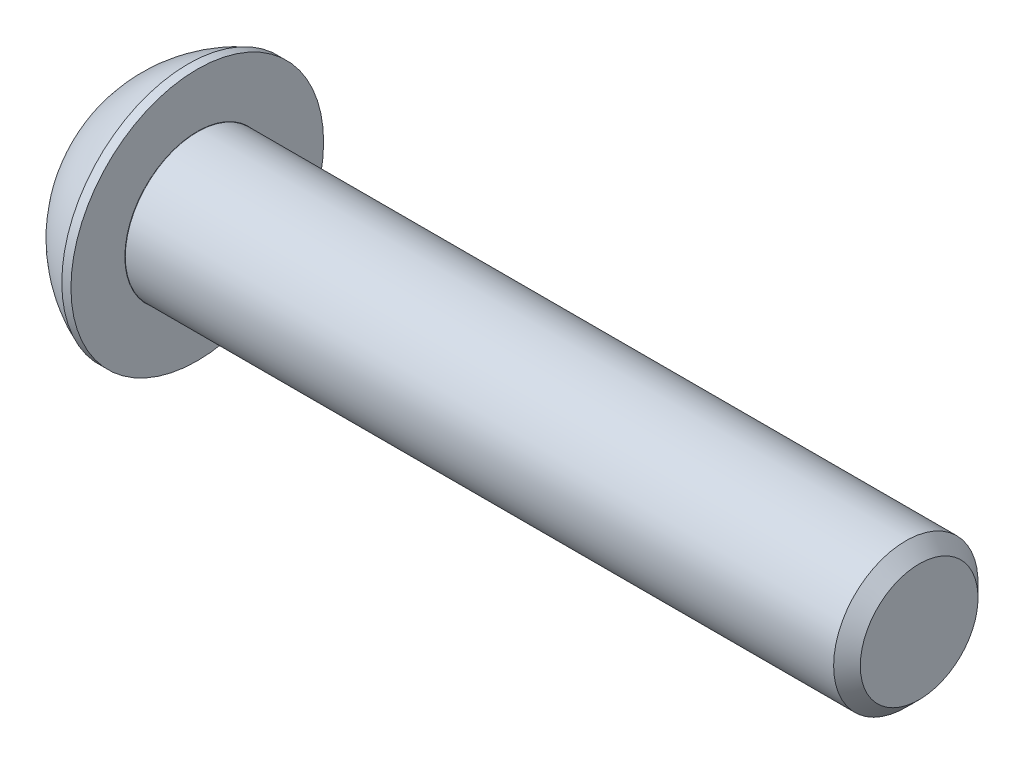
ISO-10303-21;
HEADER;
FILE_DESCRIPTION(('STEP AP214'),'2;1');
FILE_NAME('part.step','',(''),(''),'','','');
FILE_SCHEMA(('AUTOMOTIVE_DESIGN { 1 0 10303 214 1 1 1 1 }'));
ENDSEC;
DATA;
#1=APPLICATION_CONTEXT('core data for automotive mechanical design processes');
#2=APPLICATION_PROTOCOL_DEFINITION('international standard','automotive_design',2000,#1);
#3=PRODUCT_CONTEXT('',#1,'mechanical');
#4=PRODUCT('Part','Part','',(#3));
#5=PRODUCT_RELATED_PRODUCT_CATEGORY('part','',(#4));
#6=PRODUCT_DEFINITION_FORMATION('','',#4);
#7=PRODUCT_DEFINITION_CONTEXT('part definition',#1,'design');
#8=PRODUCT_DEFINITION('design','',#6,#7);
#9=PRODUCT_DEFINITION_SHAPE('','',#8);
#10=(LENGTH_UNIT() NAMED_UNIT(*) SI_UNIT(.MILLI.,.METRE.));
#11=(NAMED_UNIT(*) PLANE_ANGLE_UNIT() SI_UNIT($,.RADIAN.));
#12=(NAMED_UNIT(*) SI_UNIT($,.STERADIAN.) SOLID_ANGLE_UNIT());
#13=UNCERTAINTY_MEASURE_WITH_UNIT(LENGTH_MEASURE(1.E-05),#10,'distance_accuracy_value','');
#14=(GEOMETRIC_REPRESENTATION_CONTEXT(3) GLOBAL_UNCERTAINTY_ASSIGNED_CONTEXT((#13)) GLOBAL_UNIT_ASSIGNED_CONTEXT((#10,
#11,#12)) REPRESENTATION_CONTEXT('',''));
#15=CARTESIAN_POINT('',(0.,0.,0.));
#16=DIRECTION('',(0.,0.,1.));
#17=DIRECTION('',(1.,0.,0.));
#18=AXIS2_PLACEMENT_3D('',#15,#16,#17);
#19=CARTESIAN_POINT('',(0.,0.,0.));
#20=DIRECTION('',(-1.,0.,0.));
#21=DIRECTION('',(0.,0.,1.));
#22=AXIS2_PLACEMENT_3D('',#19,#20,#21);
#23=PLANE('',#22);
#24=CARTESIAN_POINT('',(0.,0.,0.));
#25=DIRECTION('',(-1.,0.,0.));
#26=DIRECTION('',(0.,0.,1.));
#27=AXIS2_PLACEMENT_3D('',#24,#25,#26);
#28=CIRCLE('',#27,2.625);
#29=CARTESIAN_POINT('',(0.,0.,2.625));
#30=VERTEX_POINT('',#29);
#31=EDGE_CURVE('E156',#30,#30,#28,.T.);
#32=ORIENTED_EDGE('',*,*,#31,.T.);
#33=EDGE_LOOP('',(#32));
#34=FACE_BOUND('',#33,.T.);
#35=DIRECTION('',(0.,-1.,0.));
#36=VECTOR('',#35,1.);
#37=CARTESIAN_POINT('',(0.,-1.15470053837925,2.));
#38=LINE('',#37,#36);
#39=CARTESIAN_POINT('',(0.,1.15470053837925,2.));
#40=VERTEX_POINT('',#39);
#41=CARTESIAN_POINT('',(0.,-1.15470053837925,2.));
#42=VERTEX_POINT('',#41);
#43=EDGE_CURVE('E51',#40,#42,#38,.T.);
#44=ORIENTED_EDGE('',*,*,#43,.T.);
#45=DIRECTION('',(0.,-0.500000000000001,-0.866025403784438));
#46=VECTOR('',#45,1.);
#47=CARTESIAN_POINT('',(0.,-2.3094010767585,0.));
#48=LINE('',#47,#46);
#49=CARTESIAN_POINT('',(0.,-2.3094010767585,0.));
#50=VERTEX_POINT('',#49);
#51=EDGE_CURVE('E276',#42,#50,#48,.T.);
#52=ORIENTED_EDGE('',*,*,#51,.T.);
#53=DIRECTION('',(0.,0.500000000000001,-0.866025403784438));
#54=VECTOR('',#53,1.);
#55=CARTESIAN_POINT('',(0.,-1.15470053837925,-2.));
#56=LINE('',#55,#54);
#57=CARTESIAN_POINT('',(0.,-1.15470053837925,-2.));
#58=VERTEX_POINT('',#57);
#59=EDGE_CURVE('E131',#50,#58,#56,.T.);
#60=ORIENTED_EDGE('',*,*,#59,.T.);
#61=DIRECTION('',(0.,1.,0.));
#62=VECTOR('',#61,1.);
#63=CARTESIAN_POINT('',(0.,1.15470053837925,-2.));
#64=LINE('',#63,#62);
#65=CARTESIAN_POINT('',(0.,1.15470053837925,-2.));
#66=VERTEX_POINT('',#65);
#67=EDGE_CURVE('E279',#58,#66,#64,.T.);
#68=ORIENTED_EDGE('',*,*,#67,.T.);
#69=DIRECTION('',(0.,0.5,0.866025403784438));
#70=VECTOR('',#69,1.);
#71=CARTESIAN_POINT('',(0.,2.30940107675851,0.));
#72=LINE('',#71,#70);
#73=CARTESIAN_POINT('',(0.,2.30940107675851,0.));
#74=VERTEX_POINT('',#73);
#75=EDGE_CURVE('E281',#66,#74,#72,.T.);
#76=ORIENTED_EDGE('',*,*,#75,.T.);
#77=DIRECTION('',(0.,-0.500000000000001,0.866025403784438));
#78=VECTOR('',#77,1.);
#79=CARTESIAN_POINT('',(0.,1.15470053837925,2.));
#80=LINE('',#79,#78);
#81=EDGE_CURVE('E283',#74,#40,#80,.T.);
#82=ORIENTED_EDGE('',*,*,#81,.T.);
#83=EDGE_LOOP('',(#44,#52,#60,#68,#76,#82));
#84=FACE_BOUND('',#83,.T.);
#85=ADVANCED_FACE('F36',(#34,#84),#23,.T.);
#86=CARTESIAN_POINT('',(4.99970462328768,0.,0.));
#87=DIRECTION('',(-1.,0.,0.));
#88=DIRECTION('',(0.,1.,0.));
#89=AXIS2_PLACEMENT_3D('',#86,#87,#88);
#90=SPHERICAL_SURFACE('',#89,5.64691697478582);
#91=CARTESIAN_POINT('',(2.92,0.,0.));
#92=DIRECTION('',(-1.,0.,0.));
#93=DIRECTION('',(0.,0.,1.));
#94=AXIS2_PLACEMENT_3D('',#91,#92,#93);
#95=CIRCLE('',#94,5.25);
#96=CARTESIAN_POINT('',(2.92,0.,5.25));
#97=VERTEX_POINT('',#96);
#98=EDGE_CURVE('E153',#97,#97,#95,.T.);
#99=ORIENTED_EDGE('',*,*,#98,.T.);
#100=EDGE_LOOP('',(#99));
#101=FACE_BOUND('',#100,.T.);
#102=ORIENTED_EDGE('',*,*,#31,.F.);
#103=EDGE_LOOP('',(#102));
#104=FACE_BOUND('',#103,.T.);
#105=ADVANCED_FACE('F177',(#101,#104),#90,.T.);
#106=CARTESIAN_POINT('',(0.,0.,0.));
#107=DIRECTION('',(-1.,0.,0.));
#108=DIRECTION('',(0.,0.,1.));
#109=AXIS2_PLACEMENT_3D('',#106,#107,#108);
#110=CYLINDRICAL_SURFACE('',#109,5.25);
#111=ORIENTED_EDGE('',*,*,#98,.F.);
#112=EDGE_LOOP('',(#111));
#113=FACE_BOUND('',#112,.T.);
#114=CARTESIAN_POINT('',(3.3,0.,0.));
#115=DIRECTION('',(-1.,0.,0.));
#116=DIRECTION('',(0.,0.,1.));
#117=AXIS2_PLACEMENT_3D('',#114,#115,#116);
#118=CIRCLE('',#117,5.25);
#119=CARTESIAN_POINT('',(3.3,0.,5.25));
#120=VERTEX_POINT('',#119);
#121=EDGE_CURVE('E150',#120,#120,#118,.T.);
#122=ORIENTED_EDGE('',*,*,#121,.T.);
#123=EDGE_LOOP('',(#122));
#124=FACE_BOUND('',#123,.T.);
#125=ADVANCED_FACE('F182',(#113,#124),#110,.T.);
#126=CARTESIAN_POINT('',(3.3,3.,0.));
#127=DIRECTION('',(-1.,0.,0.));
#128=DIRECTION('',(0.,0.,1.));
#129=AXIS2_PLACEMENT_3D('',#126,#127,#128);
#130=PLANE('',#129);
#131=CARTESIAN_POINT('',(3.3,0.,0.));
#132=DIRECTION('',(-1.,0.,0.));
#133=DIRECTION('',(0.,0.,1.));
#134=AXIS2_PLACEMENT_3D('',#131,#132,#133);
#135=CIRCLE('',#134,3.01);
#136=CARTESIAN_POINT('',(3.3,0.,3.01));
#137=VERTEX_POINT('',#136);
#138=EDGE_CURVE('E44',#137,#137,#135,.T.);
#139=ORIENTED_EDGE('',*,*,#138,.T.);
#140=EDGE_LOOP('',(#139));
#141=FACE_BOUND('',#140,.T.);
#142=ORIENTED_EDGE('',*,*,#121,.F.);
#143=EDGE_LOOP('',(#142));
#144=FACE_BOUND('',#143,.T.);
#145=ADVANCED_FACE('F161',(#141,#144),#130,.F.);
#146=CARTESIAN_POINT('',(0.,0.,0.));
#147=DIRECTION('',(-1.,0.,0.));
#148=DIRECTION('',(0.,0.,1.));
#149=AXIS2_PLACEMENT_3D('',#146,#147,#148);
#150=CYLINDRICAL_SURFACE('',#149,3.);
#151=CARTESIAN_POINT('',(3.31,0.,0.));
#152=DIRECTION('',(-1.,0.,0.));
#153=DIRECTION('',(0.,0.,1.));
#154=AXIS2_PLACEMENT_3D('',#151,#152,#153);
#155=CIRCLE('',#154,3.);
#156=CARTESIAN_POINT('',(3.31,0.,3.));
#157=VERTEX_POINT('',#156);
#158=EDGE_CURVE('E11',#157,#157,#155,.F.);
#159=ORIENTED_EDGE('',*,*,#158,.T.);
#160=EDGE_LOOP('',(#159));
#161=FACE_BOUND('',#160,.T.);
#162=CARTESIAN_POINT('',(32.7455,0.,0.));
#163=DIRECTION('',(-1.,0.,0.));
#164=DIRECTION('',(0.,0.,1.));
#165=AXIS2_PLACEMENT_3D('',#162,#163,#164);
#166=CIRCLE('',#165,3.);
#167=CARTESIAN_POINT('',(32.7455,0.,3.));
#168=VERTEX_POINT('',#167);
#169=EDGE_CURVE('E147',#168,#168,#166,.T.);
#170=ORIENTED_EDGE('',*,*,#169,.T.);
#171=EDGE_LOOP('',(#170));
#172=FACE_BOUND('',#171,.T.);
#173=ADVANCED_FACE('F191',(#161,#172),#150,.T.);
#174=CARTESIAN_POINT('',(33.3,0.,0.));
#175=DIRECTION('',(-1.,0.,0.));
#176=DIRECTION('',(0.,0.,1.));
#177=AXIS2_PLACEMENT_3D('',#174,#175,#176);
#178=CONICAL_SURFACE('',#177,2.4455,0.785398163397454);
#179=ORIENTED_EDGE('',*,*,#169,.F.);
#180=EDGE_LOOP('',(#179));
#181=FACE_BOUND('',#180,.T.);
#182=CARTESIAN_POINT('',(33.3,0.,0.));
#183=DIRECTION('',(-1.,0.,0.));
#184=DIRECTION('',(0.,0.,1.));
#185=AXIS2_PLACEMENT_3D('',#182,#183,#184);
#186=CIRCLE('',#185,2.4455);
#187=CARTESIAN_POINT('',(33.3,0.,2.4455));
#188=VERTEX_POINT('',#187);
#189=EDGE_CURVE('E143',#188,#188,#186,.T.);
#190=ORIENTED_EDGE('',*,*,#189,.T.);
#191=EDGE_LOOP('',(#190));
#192=FACE_BOUND('',#191,.T.);
#193=ADVANCED_FACE('F172',(#181,#192),#178,.T.);
#194=CARTESIAN_POINT('',(33.3,0.,0.));
#195=DIRECTION('',(-1.,0.,0.));
#196=DIRECTION('',(0.,0.,1.));
#197=AXIS2_PLACEMENT_3D('',#194,#195,#196);
#198=PLANE('',#197);
#199=ORIENTED_EDGE('',*,*,#189,.F.);
#200=EDGE_LOOP('',(#199));
#201=FACE_BOUND('',#200,.T.);
#202=ADVANCED_FACE('F165',(#201),#198,.F.);
#203=CARTESIAN_POINT('',(3.31,0.,0.));
#204=DIRECTION('',(-1.,0.,0.));
#205=DIRECTION('',(0.,0.,1.));
#206=AXIS2_PLACEMENT_3D('',#203,#204,#205);
#207=TOROIDAL_SURFACE('',#206,3.01,0.01);
#208=ORIENTED_EDGE('',*,*,#158,.F.);
#209=EDGE_LOOP('',(#208));
#210=FACE_BOUND('',#209,.T.);
#211=ORIENTED_EDGE('',*,*,#138,.F.);
#212=EDGE_LOOP('',(#211));
#213=FACE_BOUND('',#212,.T.);
#214=ADVANCED_FACE('F38',(#210,#213),#207,.F.);
#215=CARTESIAN_POINT('',(2.08,-2.3094010767585,0.));
#216=DIRECTION('',(0.,0.866025403784438,-0.500000000000001));
#217=DIRECTION('',(0.,0.500000000000001,0.866025403784438));
#218=AXIS2_PLACEMENT_3D('',#215,#216,#217);
#219=PLANE('',#218);
#220=DIRECTION('',(0.,-0.500000000000001,-0.866025403784438));
#221=VECTOR('',#220,1.);
#222=CARTESIAN_POINT('',(2.08,-2.3094010767585,0.));
#223=LINE('',#222,#221);
#224=CARTESIAN_POINT('',(2.08,-1.15470053837925,2.));
#225=VERTEX_POINT('',#224);
#226=CARTESIAN_POINT('',(2.08,-1.73205080756888,1.));
#227=VERTEX_POINT('',#226);
#228=EDGE_CURVE('E117',#225,#227,#223,.T.);
#229=ORIENTED_EDGE('',*,*,#228,.T.);
#230=CARTESIAN_POINT('',(2.08,-2.3094010767585,0.));
#231=VERTEX_POINT('',#230);
#232=EDGE_CURVE('E112',#227,#231,#223,.T.);
#233=ORIENTED_EDGE('',*,*,#232,.T.);
#234=DIRECTION('',(-1.,0.,0.));
#235=VECTOR('',#234,1.);
#236=CARTESIAN_POINT('',(2.08,-2.3094010767585,0.));
#237=LINE('',#236,#235);
#238=EDGE_CURVE('E114',#231,#50,#237,.T.);
#239=ORIENTED_EDGE('',*,*,#238,.T.);
#240=ORIENTED_EDGE('',*,*,#51,.F.);
#241=DIRECTION('',(-1.,0.,0.));
#242=VECTOR('',#241,1.);
#243=CARTESIAN_POINT('',(2.08,-1.15470053837925,2.));
#244=LINE('',#243,#242);
#245=EDGE_CURVE('E272',#225,#42,#244,.T.);
#246=ORIENTED_EDGE('',*,*,#245,.F.);
#247=EDGE_LOOP('',(#229,#233,#239,#240,#246));
#248=FACE_BOUND('',#247,.T.);
#249=ADVANCED_FACE('F113',(#248),#219,.T.);
#250=CARTESIAN_POINT('',(2.08,-1.15470053837925,-2.));
#251=DIRECTION('',(0.,0.866025403784438,0.500000000000001));
#252=DIRECTION('',(0.,-0.500000000000001,0.866025403784438));
#253=AXIS2_PLACEMENT_3D('',#250,#251,#252);
#254=PLANE('',#253);
#255=DIRECTION('',(0.,0.500000000000001,-0.866025403784438));
#256=VECTOR('',#255,1.);
#257=CARTESIAN_POINT('',(2.08,-1.15470053837925,-2.));
#258=LINE('',#257,#256);
#259=CARTESIAN_POINT('',(2.08,-1.73205080756888,-1.));
#260=VERTEX_POINT('',#259);
#261=EDGE_CURVE('E59',#231,#260,#258,.T.);
#262=ORIENTED_EDGE('',*,*,#261,.T.);
#263=CARTESIAN_POINT('',(2.08,-1.15470053837925,-2.));
#264=VERTEX_POINT('',#263);
#265=EDGE_CURVE('E126',#260,#264,#258,.T.);
#266=ORIENTED_EDGE('',*,*,#265,.T.);
#267=DIRECTION('',(-1.,0.,0.));
#268=VECTOR('',#267,1.);
#269=CARTESIAN_POINT('',(2.08,-1.15470053837925,-2.));
#270=LINE('',#269,#268);
#271=EDGE_CURVE('E133',#264,#58,#270,.T.);
#272=ORIENTED_EDGE('',*,*,#271,.T.);
#273=ORIENTED_EDGE('',*,*,#59,.F.);
#274=ORIENTED_EDGE('',*,*,#238,.F.);
#275=EDGE_LOOP('',(#262,#266,#272,#273,#274));
#276=FACE_BOUND('',#275,.T.);
#277=ADVANCED_FACE('F129',(#276),#254,.T.);
#278=CARTESIAN_POINT('',(2.08,1.15470053837925,-2.));
#279=DIRECTION('',(0.,0.,1.));
#280=DIRECTION('',(1.,0.,0.));
#281=AXIS2_PLACEMENT_3D('',#278,#279,#280);
#282=PLANE('',#281);
#283=DIRECTION('',(0.,1.,0.));
#284=VECTOR('',#283,1.);
#285=CARTESIAN_POINT('',(2.08,1.15470053837925,-2.));
#286=LINE('',#285,#284);
#287=CARTESIAN_POINT('',(2.08,0.,-2.));
#288=VERTEX_POINT('',#287);
#289=EDGE_CURVE('E253',#264,#288,#286,.T.);
#290=ORIENTED_EDGE('',*,*,#289,.T.);
#291=CARTESIAN_POINT('',(2.08,1.15470053837925,-2.));
#292=VERTEX_POINT('',#291);
#293=EDGE_CURVE('E125',#288,#292,#286,.T.);
#294=ORIENTED_EDGE('',*,*,#293,.T.);
#295=DIRECTION('',(-1.,0.,0.));
#296=VECTOR('',#295,1.);
#297=CARTESIAN_POINT('',(2.08,1.15470053837925,-2.));
#298=LINE('',#297,#296);
#299=EDGE_CURVE('E138',#292,#66,#298,.T.);
#300=ORIENTED_EDGE('',*,*,#299,.T.);
#301=ORIENTED_EDGE('',*,*,#67,.F.);
#302=ORIENTED_EDGE('',*,*,#271,.F.);
#303=EDGE_LOOP('',(#290,#294,#300,#301,#302));
#304=FACE_BOUND('',#303,.T.);
#305=ADVANCED_FACE('F205',(#304),#282,.T.);
#306=CARTESIAN_POINT('',(2.08,2.30940107675851,0.));
#307=DIRECTION('',(0.,-0.866025403784438,0.5));
#308=DIRECTION('',(0.,-0.5,-0.866025403784438));
#309=AXIS2_PLACEMENT_3D('',#306,#307,#308);
#310=PLANE('',#309);
#311=DIRECTION('',(0.,0.5,0.866025403784438));
#312=VECTOR('',#311,1.);
#313=CARTESIAN_POINT('',(2.08,2.30940107675851,0.));
#314=LINE('',#313,#312);
#315=CARTESIAN_POINT('',(2.08,1.73205080756888,-1.));
#316=VERTEX_POINT('',#315);
#317=EDGE_CURVE('E242',#292,#316,#314,.T.);
#318=ORIENTED_EDGE('',*,*,#317,.T.);
#319=CARTESIAN_POINT('',(2.08,2.30940107675851,0.));
#320=VERTEX_POINT('',#319);
#321=EDGE_CURVE('E247',#316,#320,#314,.T.);
#322=ORIENTED_EDGE('',*,*,#321,.T.);
#323=DIRECTION('',(-1.,0.,0.));
#324=VECTOR('',#323,1.);
#325=CARTESIAN_POINT('',(2.08,2.30940107675851,0.));
#326=LINE('',#325,#324);
#327=EDGE_CURVE('E287',#320,#74,#326,.T.);
#328=ORIENTED_EDGE('',*,*,#327,.T.);
#329=ORIENTED_EDGE('',*,*,#75,.F.);
#330=ORIENTED_EDGE('',*,*,#299,.F.);
#331=EDGE_LOOP('',(#318,#322,#328,#329,#330));
#332=FACE_BOUND('',#331,.T.);
#333=ADVANCED_FACE('F208',(#332),#310,.T.);
#334=CARTESIAN_POINT('',(2.08,1.15470053837925,2.));
#335=DIRECTION('',(0.,-0.866025403784438,-0.500000000000001));
#336=DIRECTION('',(0.,0.500000000000001,-0.866025403784438));
#337=AXIS2_PLACEMENT_3D('',#334,#335,#336);
#338=PLANE('',#337);
#339=DIRECTION('',(0.,-0.500000000000001,0.866025403784438));
#340=VECTOR('',#339,1.);
#341=CARTESIAN_POINT('',(2.08,1.15470053837925,2.));
#342=LINE('',#341,#340);
#343=CARTESIAN_POINT('',(2.08,1.73205080756888,1.));
#344=VERTEX_POINT('',#343);
#345=EDGE_CURVE('E250',#320,#344,#342,.T.);
#346=ORIENTED_EDGE('',*,*,#345,.T.);
#347=CARTESIAN_POINT('',(2.08,1.15470053837925,2.));
#348=VERTEX_POINT('',#347);
#349=EDGE_CURVE('E258',#344,#348,#342,.T.);
#350=ORIENTED_EDGE('',*,*,#349,.T.);
#351=DIRECTION('',(-1.,0.,0.));
#352=VECTOR('',#351,1.);
#353=CARTESIAN_POINT('',(2.08,1.15470053837925,2.));
#354=LINE('',#353,#352);
#355=EDGE_CURVE('E271',#348,#40,#354,.T.);
#356=ORIENTED_EDGE('',*,*,#355,.T.);
#357=ORIENTED_EDGE('',*,*,#81,.F.);
#358=ORIENTED_EDGE('',*,*,#327,.F.);
#359=EDGE_LOOP('',(#346,#350,#356,#357,#358));
#360=FACE_BOUND('',#359,.T.);
#361=ADVANCED_FACE('F212',(#360),#338,.T.);
#362=CARTESIAN_POINT('',(2.08,-1.15470053837925,2.));
#363=DIRECTION('',(0.,0.,-1.));
#364=DIRECTION('',(0.,1.,0.));
#365=AXIS2_PLACEMENT_3D('',#362,#363,#364);
#366=PLANE('',#365);
#367=DIRECTION('',(0.,-1.,0.));
#368=VECTOR('',#367,1.);
#369=CARTESIAN_POINT('',(2.08,-1.15470053837925,2.));
#370=LINE('',#369,#368);
#371=CARTESIAN_POINT('',(2.08,0.,2.));
#372=VERTEX_POINT('',#371);
#373=EDGE_CURVE('E264',#348,#372,#370,.T.);
#374=ORIENTED_EDGE('',*,*,#373,.T.);
#375=EDGE_CURVE('E266',#372,#225,#370,.T.);
#376=ORIENTED_EDGE('',*,*,#375,.T.);
#377=ORIENTED_EDGE('',*,*,#245,.T.);
#378=ORIENTED_EDGE('',*,*,#43,.F.);
#379=ORIENTED_EDGE('',*,*,#355,.F.);
#380=EDGE_LOOP('',(#374,#376,#377,#378,#379));
#381=FACE_BOUND('',#380,.T.);
#382=ADVANCED_FACE('F216',(#381),#366,.T.);
#383=CARTESIAN_POINT('',(2.08,-2.3094010767585,0.));
#384=DIRECTION('',(1.,0.,0.));
#385=DIRECTION('',(0.,0.,-1.));
#386=AXIS2_PLACEMENT_3D('',#383,#384,#385);
#387=PLANE('',#386);
#388=CARTESIAN_POINT('',(2.08,0.,0.));
#389=DIRECTION('',(-1.,0.,0.));
#390=DIRECTION('',(0.,0.,1.));
#391=AXIS2_PLACEMENT_3D('',#388,#389,#390);
#392=CIRCLE('',#391,2.);
#393=EDGE_CURVE('E239',#316,#288,#392,.T.);
#394=ORIENTED_EDGE('',*,*,#393,.F.);
#395=ORIENTED_EDGE('',*,*,#317,.F.);
#396=ORIENTED_EDGE('',*,*,#293,.F.);
#397=EDGE_LOOP('',(#394,#395,#396));
#398=FACE_BOUND('',#397,.T.);
#399=ADVANCED_FACE('F220',(#398),#387,.F.);
#400=EDGE_CURVE('E144',#344,#316,#392,.T.);
#401=ORIENTED_EDGE('',*,*,#400,.F.);
#402=ORIENTED_EDGE('',*,*,#345,.F.);
#403=ORIENTED_EDGE('',*,*,#321,.F.);
#404=EDGE_LOOP('',(#401,#402,#403));
#405=FACE_BOUND('',#404,.T.);
#406=ADVANCED_FACE('F229',(#405),#387,.F.);
#407=EDGE_CURVE('E137',#372,#344,#392,.T.);
#408=ORIENTED_EDGE('',*,*,#407,.F.);
#409=ORIENTED_EDGE('',*,*,#373,.F.);
#410=ORIENTED_EDGE('',*,*,#349,.F.);
#411=EDGE_LOOP('',(#408,#409,#410));
#412=FACE_BOUND('',#411,.T.);
#413=ADVANCED_FACE('F234',(#412),#387,.F.);
#414=EDGE_CURVE('E132',#227,#372,#392,.T.);
#415=ORIENTED_EDGE('',*,*,#414,.F.);
#416=ORIENTED_EDGE('',*,*,#228,.F.);
#417=ORIENTED_EDGE('',*,*,#375,.F.);
#418=EDGE_LOOP('',(#415,#416,#417));
#419=FACE_BOUND('',#418,.T.);
#420=ADVANCED_FACE('F227',(#419),#387,.F.);
#421=EDGE_CURVE('E123',#260,#227,#392,.T.);
#422=ORIENTED_EDGE('',*,*,#421,.F.);
#423=ORIENTED_EDGE('',*,*,#261,.F.);
#424=ORIENTED_EDGE('',*,*,#232,.F.);
#425=EDGE_LOOP('',(#422,#423,#424));
#426=FACE_BOUND('',#425,.T.);
#427=ADVANCED_FACE('F122',(#426),#387,.F.);
#428=EDGE_CURVE('E245',#288,#260,#392,.T.);
#429=ORIENTED_EDGE('',*,*,#428,.F.);
#430=ORIENTED_EDGE('',*,*,#289,.F.);
#431=ORIENTED_EDGE('',*,*,#265,.F.);
#432=EDGE_LOOP('',(#429,#430,#431));
#433=FACE_BOUND('',#432,.T.);
#434=ADVANCED_FACE('F200',(#433),#387,.F.);
#435=CARTESIAN_POINT('',(3.23470053837926,0.,0.));
#436=DIRECTION('',(-1.,0.,0.));
#437=DIRECTION('',(0.,0.,1.));
#438=AXIS2_PLACEMENT_3D('',#435,#436,#437);
#439=CONICAL_SURFACE('',#438,0.,1.04719755119659);
#440=ORIENTED_EDGE('',*,*,#407,.T.);
#441=ORIENTED_EDGE('',*,*,#400,.T.);
#442=ORIENTED_EDGE('',*,*,#393,.T.);
#443=ORIENTED_EDGE('',*,*,#428,.T.);
#444=ORIENTED_EDGE('',*,*,#421,.T.);
#445=ORIENTED_EDGE('',*,*,#414,.T.);
#446=EDGE_LOOP('',(#440,#441,#442,#443,#444,#445));
#447=FACE_BOUND('',#446,.T.);
#448=CARTESIAN_POINT('',(3.23470053837926,0.,0.));
#449=VERTEX_POINT('',#448);
#450=VERTEX_LOOP('',#449);
#451=FACE_BOUND('',#450,.T.);
#452=ADVANCED_FACE('F198',(#447,#451),#439,.F.);
#453=CLOSED_SHELL('',(#85,#105,#125,#145,#173,#193,#202,#214,#249,#277,#305,#333,#361,#382,#399,
#406,#413,#420,#427,#434,#452));
#454=MANIFOLD_SOLID_BREP('B2',#453);
#455=ADVANCED_BREP_SHAPE_REPRESENTATION('',(#18,#454),#14);
#456=SHAPE_DEFINITION_REPRESENTATION(#9,#455);
ENDSEC;
END-ISO-10303-21;
